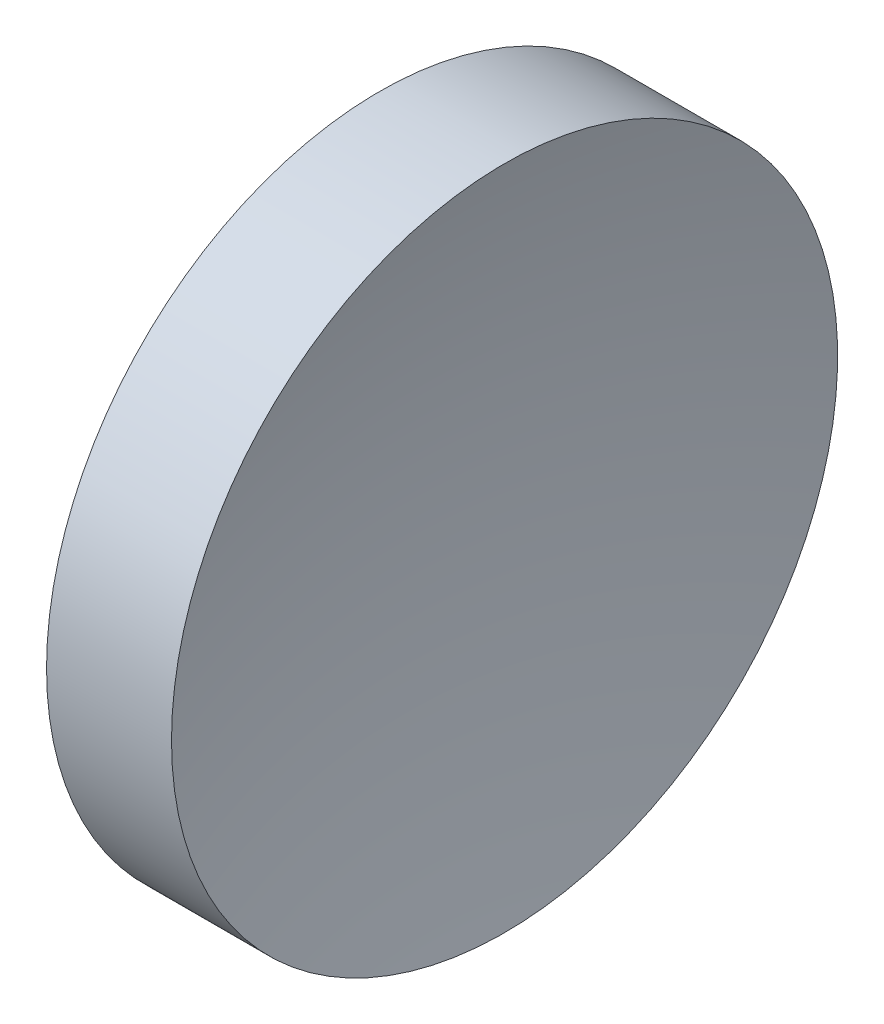
ISO-10303-21;
HEADER;
FILE_DESCRIPTION(('STEP AP214'),'2;1');
FILE_NAME('part.step','',(''),(''),'','','');
FILE_SCHEMA(('AUTOMOTIVE_DESIGN { 1 0 10303 214 1 1 1 1 }'));
ENDSEC;
DATA;
#1=APPLICATION_CONTEXT('core data for automotive mechanical design processes');
#2=APPLICATION_PROTOCOL_DEFINITION('international standard','automotive_design',2000,#1);
#3=PRODUCT_CONTEXT('',#1,'mechanical');
#4=PRODUCT('Part','Part','',(#3));
#5=PRODUCT_RELATED_PRODUCT_CATEGORY('part','',(#4));
#6=PRODUCT_DEFINITION_FORMATION('','',#4);
#7=PRODUCT_DEFINITION_CONTEXT('part definition',#1,'design');
#8=PRODUCT_DEFINITION('design','',#6,#7);
#9=PRODUCT_DEFINITION_SHAPE('','',#8);
#10=(LENGTH_UNIT() NAMED_UNIT(*) SI_UNIT(.MILLI.,.METRE.));
#11=(NAMED_UNIT(*) PLANE_ANGLE_UNIT() SI_UNIT($,.RADIAN.));
#12=(NAMED_UNIT(*) SI_UNIT($,.STERADIAN.) SOLID_ANGLE_UNIT());
#13=UNCERTAINTY_MEASURE_WITH_UNIT(LENGTH_MEASURE(1.E-05),#10,'distance_accuracy_value','');
#14=(GEOMETRIC_REPRESENTATION_CONTEXT(3) GLOBAL_UNCERTAINTY_ASSIGNED_CONTEXT((#13)) GLOBAL_UNIT_ASSIGNED_CONTEXT((#10,
#11,#12)) REPRESENTATION_CONTEXT('',''));
#15=CARTESIAN_POINT('',(0.,0.,0.));
#16=DIRECTION('',(0.,0.,1.));
#17=DIRECTION('',(1.,0.,0.));
#18=AXIS2_PLACEMENT_3D('',#15,#16,#17);
#19=CARTESIAN_POINT('',(0.,0.,0.));
#20=DIRECTION('',(1.,0.,0.));
#21=DIRECTION('',(0.,0.,-1.));
#22=AXIS2_PLACEMENT_3D('',#19,#20,#21);
#23=PLANE('',#22);
#24=CARTESIAN_POINT('',(0.,0.,0.));
#25=DIRECTION('',(-1.,0.,0.));
#26=DIRECTION('',(0.,0.,1.));
#27=AXIS2_PLACEMENT_3D('',#24,#25,#26);
#28=CIRCLE('',#27,25.4);
#29=CARTESIAN_POINT('',(0.,0.,25.4));
#30=VERTEX_POINT('',#29);
#31=EDGE_CURVE('E39',#30,#30,#28,.T.);
#32=ORIENTED_EDGE('',*,*,#31,.T.);
#33=EDGE_LOOP('',(#32));
#34=FACE_BOUND('',#33,.T.);
#35=ADVANCED_FACE('F33',(#34),#23,.F.);
#36=CARTESIAN_POINT('',(106.25,0.,0.));
#37=DIRECTION('',(-1.,0.,0.));
#38=DIRECTION('',(0.,0.,1.));
#39=AXIS2_PLACEMENT_3D('',#36,#37,#38);
#40=SPHERICAL_SURFACE('',#39,100.);
#41=CARTESIAN_POINT('',(9.52957816469161,0.,0.));
#42=DIRECTION('',(-1.,0.,0.));
#43=DIRECTION('',(0.,0.,1.));
#44=AXIS2_PLACEMENT_3D('',#41,#42,#43);
#45=CIRCLE('',#44,25.4000000000001);
#46=CARTESIAN_POINT('',(9.52957816469161,0.,25.4000000000001));
#47=VERTEX_POINT('',#46);
#48=EDGE_CURVE('E10',#47,#47,#45,.T.);
#49=ORIENTED_EDGE('',*,*,#48,.F.);
#50=EDGE_LOOP('',(#49));
#51=FACE_BOUND('',#50,.T.);
#52=ADVANCED_FACE('F48',(#51),#40,.F.);
#53=CARTESIAN_POINT('',(0.,0.,0.));
#54=DIRECTION('',(-1.,0.,0.));
#55=DIRECTION('',(0.,0.,1.));
#56=AXIS2_PLACEMENT_3D('',#53,#54,#55);
#57=CYLINDRICAL_SURFACE('',#56,25.4);
#58=ORIENTED_EDGE('',*,*,#31,.F.);
#59=EDGE_LOOP('',(#58));
#60=FACE_BOUND('',#59,.T.);
#61=ORIENTED_EDGE('',*,*,#48,.T.);
#62=EDGE_LOOP('',(#61));
#63=FACE_BOUND('',#62,.T.);
#64=ADVANCED_FACE('F46',(#60,#63),#57,.T.);
#65=CLOSED_SHELL('',(#35,#52,#64));
#66=MANIFOLD_SOLID_BREP('B2',#65);
#67=ADVANCED_BREP_SHAPE_REPRESENTATION('',(#18,#66),#14);
#68=SHAPE_DEFINITION_REPRESENTATION(#9,#67);
ENDSEC;
END-ISO-10303-21;
